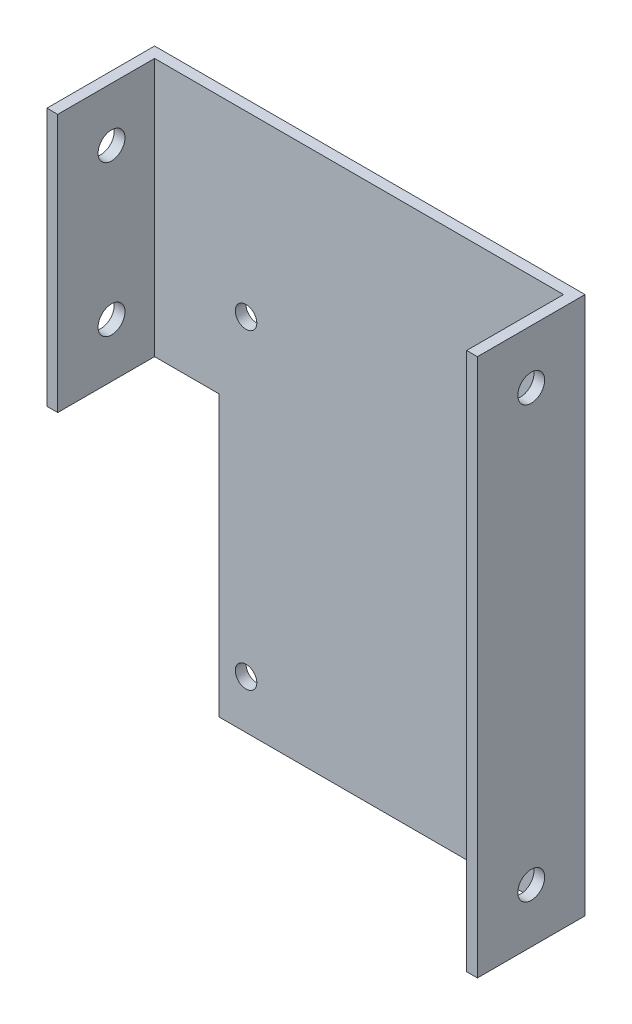
ISO-10303-21;
HEADER;
FILE_DESCRIPTION(('STEP AP214'),'2;1');
FILE_NAME('part.step','',(''),(''),'','','');
FILE_SCHEMA(('AUTOMOTIVE_DESIGN { 1 0 10303 214 1 1 1 1 }'));
ENDSEC;
DATA;
#1=APPLICATION_CONTEXT('core data for automotive mechanical design processes');
#2=APPLICATION_PROTOCOL_DEFINITION('international standard','automotive_design',2000,#1);
#3=PRODUCT_CONTEXT('',#1,'mechanical');
#4=PRODUCT('Part','Part','',(#3));
#5=PRODUCT_RELATED_PRODUCT_CATEGORY('part','',(#4));
#6=PRODUCT_DEFINITION_FORMATION('','',#4);
#7=PRODUCT_DEFINITION_CONTEXT('part definition',#1,'design');
#8=PRODUCT_DEFINITION('design','',#6,#7);
#9=PRODUCT_DEFINITION_SHAPE('','',#8);
#10=(LENGTH_UNIT() NAMED_UNIT(*) SI_UNIT(.MILLI.,.METRE.));
#11=(NAMED_UNIT(*) PLANE_ANGLE_UNIT() SI_UNIT($,.RADIAN.));
#12=(NAMED_UNIT(*) SI_UNIT($,.STERADIAN.) SOLID_ANGLE_UNIT());
#13=UNCERTAINTY_MEASURE_WITH_UNIT(LENGTH_MEASURE(1.E-05),#10,'distance_accuracy_value','');
#14=(GEOMETRIC_REPRESENTATION_CONTEXT(3) GLOBAL_UNCERTAINTY_ASSIGNED_CONTEXT((#13)) GLOBAL_UNIT_ASSIGNED_CONTEXT((#10,
#11,#12)) REPRESENTATION_CONTEXT('',''));
#15=CARTESIAN_POINT('',(0.,0.,0.));
#16=DIRECTION('',(0.,0.,1.));
#17=DIRECTION('',(1.,0.,0.));
#18=AXIS2_PLACEMENT_3D('',#15,#16,#17);
#19=CARTESIAN_POINT('',(0.,0.,1.));
#20=DIRECTION('',(0.,0.,1.));
#21=DIRECTION('',(1.,0.,0.));
#22=AXIS2_PLACEMENT_3D('',#19,#20,#21);
#23=PLANE('',#22);
#24=CARTESIAN_POINT('',(21.7424242424243,-25.6731601731602,0.999999999999999));
#25=DIRECTION('',(0.,0.,1.));
#26=DIRECTION('',(1.,0.,0.));
#27=AXIS2_PLACEMENT_3D('',#24,#25,#26);
#28=CIRCLE('',#27,1.);
#29=CARTESIAN_POINT('',(22.7424242424243,-25.6731601731602,0.999999999999999));
#30=VERTEX_POINT('',#29);
#31=EDGE_CURVE('E178',#30,#30,#28,.T.);
#32=ORIENTED_EDGE('',*,*,#31,.F.);
#33=EDGE_LOOP('',(#32));
#34=FACE_BOUND('',#33,.T.);
#35=CARTESIAN_POINT('',(-6.25757575757574,3.27845273006564,0.999999999999999));
#36=DIRECTION('',(0.,0.,1.));
#37=DIRECTION('',(1.,0.,0.));
#38=AXIS2_PLACEMENT_3D('',#35,#36,#37);
#39=CIRCLE('',#38,1.);
#40=CARTESIAN_POINT('',(-5.25757575757574,3.27845273006564,0.999999999999999));
#41=VERTEX_POINT('',#40);
#42=EDGE_CURVE('E174',#41,#41,#39,.T.);
#43=ORIENTED_EDGE('',*,*,#42,.F.);
#44=EDGE_LOOP('',(#43));
#45=FACE_BOUND('',#44,.T.);
#46=CARTESIAN_POINT('',(-6.25757575757574,-25.6731601731602,0.999999999999999));
#47=DIRECTION('',(0.,0.,1.));
#48=DIRECTION('',(1.,0.,0.));
#49=AXIS2_PLACEMENT_3D('',#46,#47,#48);
#50=CIRCLE('',#49,1.);
#51=CARTESIAN_POINT('',(-5.25757575757574,-25.6731601731602,0.999999999999999));
#52=VERTEX_POINT('',#51);
#53=EDGE_CURVE('E170',#52,#52,#50,.T.);
#54=ORIENTED_EDGE('',*,*,#53,.F.);
#55=EDGE_LOOP('',(#54));
#56=FACE_BOUND('',#55,.T.);
#57=CARTESIAN_POINT('',(21.7424242424243,3.32683982683982,0.999999999999999));
#58=DIRECTION('',(0.,0.,1.));
#59=DIRECTION('',(1.,0.,0.));
#60=AXIS2_PLACEMENT_3D('',#57,#58,#59);
#61=CIRCLE('',#60,1.);
#62=CARTESIAN_POINT('',(22.7424242424243,3.32683982683982,0.999999999999999));
#63=VERTEX_POINT('',#62);
#64=EDGE_CURVE('E166',#63,#63,#61,.T.);
#65=ORIENTED_EDGE('',*,*,#64,.F.);
#66=EDGE_LOOP('',(#65));
#67=FACE_BOUND('',#66,.T.);
#68=DIRECTION('',(1.,0.,0.));
#69=VECTOR('',#68,1.);
#70=CARTESIAN_POINT('',(24.2424242424243,-30.1731601731602,0.999999999999999));
#71=LINE('',#70,#69);
#72=CARTESIAN_POINT('',(-8.75757575757574,-30.1731601731602,0.999999999999999));
#73=VERTEX_POINT('',#72);
#74=CARTESIAN_POINT('',(23.2424242424242,-30.1731601731602,0.999999999999999));
#75=VERTEX_POINT('',#74);
#76=EDGE_CURVE('E140',#73,#75,#71,.T.);
#77=ORIENTED_EDGE('',*,*,#76,.T.);
#78=DIRECTION('',(0.,-1.,0.));
#79=VECTOR('',#78,1.);
#80=CARTESIAN_POINT('',(23.2424242424242,0.,1.));
#81=LINE('',#80,#79);
#82=CARTESIAN_POINT('',(23.2424242424242,19.8268398268398,1.));
#83=VERTEX_POINT('',#82);
#84=EDGE_CURVE('E61',#83,#75,#81,.T.);
#85=ORIENTED_EDGE('',*,*,#84,.F.);
#86=DIRECTION('',(-1.,0.,0.));
#87=VECTOR('',#86,1.);
#88=CARTESIAN_POINT('',(-15.7575757575758,19.8268398268398,1.));
#89=LINE('',#88,#87);
#90=CARTESIAN_POINT('',(-14.7575757575758,19.8268398268398,1.));
#91=VERTEX_POINT('',#90);
#92=EDGE_CURVE('E260',#83,#91,#89,.T.);
#93=ORIENTED_EDGE('',*,*,#92,.T.);
#94=DIRECTION('',(0.,1.,0.));
#95=VECTOR('',#94,1.);
#96=CARTESIAN_POINT('',(-14.7575757575758,0.,1.));
#97=LINE('',#96,#95);
#98=CARTESIAN_POINT('',(-14.7575757575758,-4.17316017316017,1.));
#99=VERTEX_POINT('',#98);
#100=EDGE_CURVE('E256',#99,#91,#97,.T.);
#101=ORIENTED_EDGE('',*,*,#100,.F.);
#102=DIRECTION('',(1.,0.,0.));
#103=VECTOR('',#102,1.);
#104=CARTESIAN_POINT('',(-15.7575757575758,-4.17316017316017,1.));
#105=LINE('',#104,#103);
#106=CARTESIAN_POINT('',(-8.75757575757575,-4.17316017316017,1.));
#107=VERTEX_POINT('',#106);
#108=EDGE_CURVE('E199',#99,#107,#105,.T.);
#109=ORIENTED_EDGE('',*,*,#108,.T.);
#110=DIRECTION('',(0.,1.,0.));
#111=VECTOR('',#110,1.);
#112=CARTESIAN_POINT('',(-8.75757575757575,-5.17316017316017,1.));
#113=LINE('',#112,#111);
#114=EDGE_CURVE('E210',#73,#107,#113,.T.);
#115=ORIENTED_EDGE('',*,*,#114,.F.);
#116=EDGE_LOOP('',(#77,#85,#93,#101,#109,#115));
#117=FACE_BOUND('',#116,.T.);
#118=ADVANCED_FACE('F43',(#34,#45,#56,#67,#117),#23,.T.);
#119=CARTESIAN_POINT('',(-15.7575757575757,-30.1731601731602,1.));
#120=DIRECTION('',(0.,1.,0.));
#121=DIRECTION('',(0.,0.,1.));
#122=AXIS2_PLACEMENT_3D('',#119,#120,#121);
#123=PLANE('',#122);
#124=ORIENTED_EDGE('',*,*,#76,.F.);
#125=DIRECTION('',(0.,0.,1.));
#126=VECTOR('',#125,1.);
#127=CARTESIAN_POINT('',(-8.75757575757574,-30.1731601731602,-52.));
#128=LINE('',#127,#126);
#129=CARTESIAN_POINT('',(-8.75757575757574,-30.1731601731602,0.));
#130=VERTEX_POINT('',#129);
#131=EDGE_CURVE('E216',#130,#73,#128,.T.);
#132=ORIENTED_EDGE('',*,*,#131,.F.);
#133=DIRECTION('',(1.,0.,0.));
#134=VECTOR('',#133,1.);
#135=CARTESIAN_POINT('',(-15.7575757575757,-30.1731601731602,0.));
#136=LINE('',#135,#134);
#137=CARTESIAN_POINT('',(24.2424242424243,-30.1731601731602,0.));
#138=VERTEX_POINT('',#137);
#139=EDGE_CURVE('E268',#130,#138,#136,.T.);
#140=ORIENTED_EDGE('',*,*,#139,.T.);
#141=DIRECTION('',(0.,0.,-1.));
#142=VECTOR('',#141,1.);
#143=CARTESIAN_POINT('',(24.2424242424243,-30.1731601731602,1.));
#144=LINE('',#143,#142);
#145=CARTESIAN_POINT('',(24.2424242424243,-30.1731601731602,10.));
#146=VERTEX_POINT('',#145);
#147=EDGE_CURVE('E53',#146,#138,#144,.T.);
#148=ORIENTED_EDGE('',*,*,#147,.F.);
#149=DIRECTION('',(1.,0.,0.));
#150=VECTOR('',#149,1.);
#151=CARTESIAN_POINT('',(24.2424242424243,-30.1731601731602,10.));
#152=LINE('',#151,#150);
#153=CARTESIAN_POINT('',(23.2424242424242,-30.1731601731602,10.));
#154=VERTEX_POINT('',#153);
#155=EDGE_CURVE('E127',#154,#146,#152,.T.);
#156=ORIENTED_EDGE('',*,*,#155,.F.);
#157=DIRECTION('',(0.,0.,-1.));
#158=VECTOR('',#157,1.);
#159=CARTESIAN_POINT('',(23.2424242424242,-30.1731601731602,10.));
#160=LINE('',#159,#158);
#161=EDGE_CURVE('E135',#154,#75,#160,.T.);
#162=ORIENTED_EDGE('',*,*,#161,.T.);
#163=EDGE_LOOP('',(#124,#132,#140,#148,#156,#162));
#164=FACE_BOUND('',#163,.T.);
#165=ADVANCED_FACE('F142',(#164),#123,.F.);
#166=CARTESIAN_POINT('',(-8.75757575757575,-5.17316017316017,-52.));
#167=DIRECTION('',(1.,0.,0.));
#168=DIRECTION('',(0.,1.,0.));
#169=AXIS2_PLACEMENT_3D('',#166,#167,#168);
#170=PLANE('',#169);
#171=ORIENTED_EDGE('',*,*,#131,.T.);
#172=ORIENTED_EDGE('',*,*,#114,.T.);
#173=DIRECTION('',(0.,0.,1.));
#174=VECTOR('',#173,1.);
#175=CARTESIAN_POINT('',(-8.75757575757574,-4.17316017316017,0.));
#176=LINE('',#175,#174);
#177=CARTESIAN_POINT('',(-8.75757575757575,-4.17316017316017,0.));
#178=VERTEX_POINT('',#177);
#179=EDGE_CURVE('E69',#178,#107,#176,.T.);
#180=ORIENTED_EDGE('',*,*,#179,.F.);
#181=DIRECTION('',(0.,1.,0.));
#182=VECTOR('',#181,1.);
#183=CARTESIAN_POINT('',(-8.75757575757575,0.,0.));
#184=LINE('',#183,#182);
#185=EDGE_CURVE('E11',#130,#178,#184,.T.);
#186=ORIENTED_EDGE('',*,*,#185,.F.);
#187=EDGE_LOOP('',(#171,#172,#180,#186));
#188=FACE_BOUND('',#187,.T.);
#189=ADVANCED_FACE('F323',(#188),#170,.F.);
#190=CARTESIAN_POINT('',(23.2424242424242,19.8268398268398,10.));
#191=DIRECTION('',(-1.,0.,0.));
#192=DIRECTION('',(0.,-1.,0.));
#193=AXIS2_PLACEMENT_3D('',#190,#191,#192);
#194=PLANE('',#193);
#195=CARTESIAN_POINT('',(23.2424242424242,-25.1731601731602,5.));
#196=DIRECTION('',(-1.,0.,0.));
#197=DIRECTION('',(0.,-1.,0.));
#198=AXIS2_PLACEMENT_3D('',#195,#196,#197);
#199=CIRCLE('',#198,1.25);
#200=CARTESIAN_POINT('',(23.2424242424242,-26.4231601731602,5.));
#201=VERTEX_POINT('',#200);
#202=EDGE_CURVE('E47',#201,#201,#199,.T.);
#203=ORIENTED_EDGE('',*,*,#202,.F.);
#204=EDGE_LOOP('',(#203));
#205=FACE_BOUND('',#204,.T.);
#206=CARTESIAN_POINT('',(23.2424242424242,14.8268398268398,5.));
#207=DIRECTION('',(-1.,0.,0.));
#208=DIRECTION('',(0.,-1.,0.));
#209=AXIS2_PLACEMENT_3D('',#206,#207,#208);
#210=CIRCLE('',#209,1.25);
#211=CARTESIAN_POINT('',(23.2424242424242,13.5768398268398,5.));
#212=VERTEX_POINT('',#211);
#213=EDGE_CURVE('E224',#212,#212,#210,.T.);
#214=ORIENTED_EDGE('',*,*,#213,.F.);
#215=EDGE_LOOP('',(#214));
#216=FACE_BOUND('',#215,.T.);
#217=ORIENTED_EDGE('',*,*,#84,.T.);
#218=ORIENTED_EDGE('',*,*,#161,.F.);
#219=DIRECTION('',(0.,1.,0.));
#220=VECTOR('',#219,1.);
#221=CARTESIAN_POINT('',(23.2424242424242,19.8268398268398,10.));
#222=LINE('',#221,#220);
#223=CARTESIAN_POINT('',(23.2424242424242,19.8268398268398,10.));
#224=VERTEX_POINT('',#223);
#225=EDGE_CURVE('E123',#154,#224,#222,.T.);
#226=ORIENTED_EDGE('',*,*,#225,.T.);
#227=DIRECTION('',(0.,0.,-1.));
#228=VECTOR('',#227,1.);
#229=CARTESIAN_POINT('',(23.2424242424242,19.8268398268398,10.));
#230=LINE('',#229,#228);
#231=EDGE_CURVE('E233',#224,#83,#230,.T.);
#232=ORIENTED_EDGE('',*,*,#231,.T.);
#233=EDGE_LOOP('',(#217,#218,#226,#232));
#234=FACE_BOUND('',#233,.T.);
#235=ADVANCED_FACE('F136',(#205,#216,#234),#194,.T.);
#236=CARTESIAN_POINT('',(-15.7575757575758,19.8268398268398,1.));
#237=DIRECTION('',(1.,0.,0.));
#238=DIRECTION('',(0.,1.,0.));
#239=AXIS2_PLACEMENT_3D('',#236,#237,#238);
#240=PLANE('',#239);
#241=CARTESIAN_POINT('',(-15.7575757575758,0.826839826839827,5.));
#242=DIRECTION('',(-1.,0.,0.));
#243=DIRECTION('',(0.,-1.,0.));
#244=AXIS2_PLACEMENT_3D('',#241,#242,#243);
#245=CIRCLE('',#244,1.25);
#246=CARTESIAN_POINT('',(-15.7575757575758,-0.423160173160173,5.));
#247=VERTEX_POINT('',#246);
#248=EDGE_CURVE('E186',#247,#247,#245,.T.);
#249=ORIENTED_EDGE('',*,*,#248,.F.);
#250=EDGE_LOOP('',(#249));
#251=FACE_BOUND('',#250,.T.);
#252=DIRECTION('',(0.,0.,1.));
#253=VECTOR('',#252,1.);
#254=CARTESIAN_POINT('',(-15.7575757575758,-4.17316017316017,0.));
#255=LINE('',#254,#253);
#256=CARTESIAN_POINT('',(-15.7575757575758,-4.17316017316017,0.));
#257=VERTEX_POINT('',#256);
#258=CARTESIAN_POINT('',(-15.7575757575758,-4.17316017316017,10.));
#259=VERTEX_POINT('',#258);
#260=EDGE_CURVE('E204',#257,#259,#255,.T.);
#261=ORIENTED_EDGE('',*,*,#260,.T.);
#262=DIRECTION('',(0.,1.,0.));
#263=VECTOR('',#262,1.);
#264=CARTESIAN_POINT('',(-15.7575757575758,19.8268398268398,10.));
#265=LINE('',#264,#263);
#266=CARTESIAN_POINT('',(-15.7575757575758,19.8268398268398,10.));
#267=VERTEX_POINT('',#266);
#268=EDGE_CURVE('E242',#259,#267,#265,.T.);
#269=ORIENTED_EDGE('',*,*,#268,.T.);
#270=DIRECTION('',(0.,0.,-1.));
#271=VECTOR('',#270,1.);
#272=CARTESIAN_POINT('',(-15.7575757575758,19.8268398268398,1.));
#273=LINE('',#272,#271);
#274=CARTESIAN_POINT('',(-15.7575757575758,19.8268398268398,0.));
#275=VERTEX_POINT('',#274);
#276=EDGE_CURVE('E264',#267,#275,#273,.T.);
#277=ORIENTED_EDGE('',*,*,#276,.T.);
#278=DIRECTION('',(0.,-1.,0.));
#279=VECTOR('',#278,1.);
#280=CARTESIAN_POINT('',(-15.7575757575758,19.8268398268398,0.));
#281=LINE('',#280,#279);
#282=EDGE_CURVE('E259',#275,#257,#281,.T.);
#283=ORIENTED_EDGE('',*,*,#282,.T.);
#284=EDGE_LOOP('',(#261,#269,#277,#283));
#285=FACE_BOUND('',#284,.T.);
#286=CARTESIAN_POINT('',(-15.7575757575758,14.8268398268398,5.));
#287=DIRECTION('',(1.,0.,0.));
#288=DIRECTION('',(0.,1.,0.));
#289=AXIS2_PLACEMENT_3D('',#286,#287,#288);
#290=CIRCLE('',#289,1.25);
#291=CARTESIAN_POINT('',(-15.7575757575758,16.0768398268398,5.));
#292=VERTEX_POINT('',#291);
#293=EDGE_CURVE('E229',#292,#292,#290,.T.);
#294=ORIENTED_EDGE('',*,*,#293,.T.);
#295=EDGE_LOOP('',(#294));
#296=FACE_BOUND('',#295,.T.);
#297=ADVANCED_FACE('F45',(#251,#285,#296),#240,.F.);
#298=CARTESIAN_POINT('',(24.2424242424242,19.8268398268398,1.));
#299=DIRECTION('',(-1.,0.,0.));
#300=DIRECTION('',(0.,-1.,0.));
#301=AXIS2_PLACEMENT_3D('',#298,#299,#300);
#302=PLANE('',#301);
#303=DIRECTION('',(0.,-1.,0.));
#304=VECTOR('',#303,1.);
#305=CARTESIAN_POINT('',(24.2424242424242,19.8268398268398,10.));
#306=LINE('',#305,#304);
#307=CARTESIAN_POINT('',(24.2424242424242,19.8268398268398,10.));
#308=VERTEX_POINT('',#307);
#309=EDGE_CURVE('E132',#308,#146,#306,.T.);
#310=ORIENTED_EDGE('',*,*,#309,.T.);
#311=ORIENTED_EDGE('',*,*,#147,.T.);
#312=DIRECTION('',(0.,1.,0.));
#313=VECTOR('',#312,1.);
#314=CARTESIAN_POINT('',(24.2424242424242,19.8268398268398,0.));
#315=LINE('',#314,#313);
#316=CARTESIAN_POINT('',(24.2424242424242,19.8268398268398,0.));
#317=VERTEX_POINT('',#316);
#318=EDGE_CURVE('E271',#138,#317,#315,.T.);
#319=ORIENTED_EDGE('',*,*,#318,.T.);
#320=DIRECTION('',(0.,0.,-1.));
#321=VECTOR('',#320,1.);
#322=CARTESIAN_POINT('',(24.2424242424242,19.8268398268398,1.));
#323=LINE('',#322,#321);
#324=EDGE_CURVE('E279',#308,#317,#323,.T.);
#325=ORIENTED_EDGE('',*,*,#324,.F.);
#326=EDGE_LOOP('',(#310,#311,#319,#325));
#327=FACE_BOUND('',#326,.T.);
#328=CARTESIAN_POINT('',(24.2424242424242,14.8268398268398,5.));
#329=DIRECTION('',(1.,0.,0.));
#330=DIRECTION('',(0.,1.,0.));
#331=AXIS2_PLACEMENT_3D('',#328,#329,#330);
#332=CIRCLE('',#331,1.25);
#333=CARTESIAN_POINT('',(24.2424242424242,16.0768398268398,5.));
#334=VERTEX_POINT('',#333);
#335=EDGE_CURVE('E220',#334,#334,#332,.T.);
#336=ORIENTED_EDGE('',*,*,#335,.F.);
#337=EDGE_LOOP('',(#336));
#338=FACE_BOUND('',#337,.T.);
#339=CARTESIAN_POINT('',(24.2424242424243,-25.1731601731602,5.));
#340=DIRECTION('',(1.,0.,0.));
#341=DIRECTION('',(0.,1.,0.));
#342=AXIS2_PLACEMENT_3D('',#339,#340,#341);
#343=CIRCLE('',#342,1.25);
#344=CARTESIAN_POINT('',(24.2424242424243,-23.9231601731602,5.));
#345=VERTEX_POINT('',#344);
#346=EDGE_CURVE('E182',#345,#345,#343,.T.);
#347=ORIENTED_EDGE('',*,*,#346,.F.);
#348=EDGE_LOOP('',(#347));
#349=FACE_BOUND('',#348,.T.);
#350=ADVANCED_FACE('F313',(#327,#338,#349),#302,.F.);
#351=CARTESIAN_POINT('',(-15.7575757575758,19.8268398268398,1.));
#352=DIRECTION('',(0.,-1.,0.));
#353=DIRECTION('',(0.,0.,-1.));
#354=AXIS2_PLACEMENT_3D('',#351,#352,#353);
#355=PLANE('',#354);
#356=ORIENTED_EDGE('',*,*,#92,.F.);
#357=ORIENTED_EDGE('',*,*,#231,.F.);
#358=DIRECTION('',(1.,0.,0.));
#359=VECTOR('',#358,1.);
#360=CARTESIAN_POINT('',(24.2424242424242,19.8268398268398,10.));
#361=LINE('',#360,#359);
#362=EDGE_CURVE('E129',#224,#308,#361,.T.);
#363=ORIENTED_EDGE('',*,*,#362,.T.);
#364=ORIENTED_EDGE('',*,*,#324,.T.);
#365=DIRECTION('',(-1.,0.,0.));
#366=VECTOR('',#365,1.);
#367=CARTESIAN_POINT('',(-15.7575757575758,19.8268398268398,0.));
#368=LINE('',#367,#366);
#369=EDGE_CURVE('E265',#317,#275,#368,.T.);
#370=ORIENTED_EDGE('',*,*,#369,.T.);
#371=ORIENTED_EDGE('',*,*,#276,.F.);
#372=DIRECTION('',(1.,0.,0.));
#373=VECTOR('',#372,1.);
#374=CARTESIAN_POINT('',(-15.7575757575758,19.8268398268398,10.));
#375=LINE('',#374,#373);
#376=CARTESIAN_POINT('',(-14.7575757575758,19.8268398268398,10.));
#377=VERTEX_POINT('',#376);
#378=EDGE_CURVE('E245',#267,#377,#375,.T.);
#379=ORIENTED_EDGE('',*,*,#378,.T.);
#380=DIRECTION('',(0.,0.,-1.));
#381=VECTOR('',#380,1.);
#382=CARTESIAN_POINT('',(-14.7575757575758,19.8268398268398,10.));
#383=LINE('',#382,#381);
#384=EDGE_CURVE('E252',#377,#91,#383,.T.);
#385=ORIENTED_EDGE('',*,*,#384,.T.);
#386=EDGE_LOOP('',(#356,#357,#363,#364,#370,#371,#379,#385));
#387=FACE_BOUND('',#386,.T.);
#388=ADVANCED_FACE('F319',(#387),#355,.F.);
#389=CARTESIAN_POINT('',(0.,0.,0.));
#390=DIRECTION('',(0.,0.,1.));
#391=DIRECTION('',(1.,0.,0.));
#392=AXIS2_PLACEMENT_3D('',#389,#390,#391);
#393=PLANE('',#392);
#394=CARTESIAN_POINT('',(21.7424242424243,-25.6731601731602,0.));
#395=DIRECTION('',(0.,0.,-1.));
#396=DIRECTION('',(-1.,0.,0.));
#397=AXIS2_PLACEMENT_3D('',#394,#395,#396);
#398=CIRCLE('',#397,1.);
#399=CARTESIAN_POINT('',(20.7424242424243,-25.6731601731602,0.));
#400=VERTEX_POINT('',#399);
#401=EDGE_CURVE('E150',#400,#400,#398,.T.);
#402=ORIENTED_EDGE('',*,*,#401,.F.);
#403=EDGE_LOOP('',(#402));
#404=FACE_BOUND('',#403,.T.);
#405=CARTESIAN_POINT('',(-6.25757575757574,3.27845273006564,0.));
#406=DIRECTION('',(0.,0.,-1.));
#407=DIRECTION('',(-1.,0.,0.));
#408=AXIS2_PLACEMENT_3D('',#405,#406,#407);
#409=CIRCLE('',#408,1.);
#410=CARTESIAN_POINT('',(-7.25757575757574,3.27845273006564,0.));
#411=VERTEX_POINT('',#410);
#412=EDGE_CURVE('E156',#411,#411,#409,.T.);
#413=ORIENTED_EDGE('',*,*,#412,.F.);
#414=EDGE_LOOP('',(#413));
#415=FACE_BOUND('',#414,.T.);
#416=CARTESIAN_POINT('',(-6.25757575757574,-25.6731601731602,0.));
#417=DIRECTION('',(0.,0.,-1.));
#418=DIRECTION('',(-1.,0.,0.));
#419=AXIS2_PLACEMENT_3D('',#416,#417,#418);
#420=CIRCLE('',#419,1.);
#421=CARTESIAN_POINT('',(-7.25757575757574,-25.6731601731602,0.));
#422=VERTEX_POINT('',#421);
#423=EDGE_CURVE('E151',#422,#422,#420,.T.);
#424=ORIENTED_EDGE('',*,*,#423,.F.);
#425=EDGE_LOOP('',(#424));
#426=FACE_BOUND('',#425,.T.);
#427=CARTESIAN_POINT('',(21.7424242424243,3.32683982683982,0.));
#428=DIRECTION('',(0.,0.,-1.));
#429=DIRECTION('',(-1.,0.,0.));
#430=AXIS2_PLACEMENT_3D('',#427,#428,#429);
#431=CIRCLE('',#430,1.);
#432=CARTESIAN_POINT('',(20.7424242424243,3.32683982683982,0.));
#433=VERTEX_POINT('',#432);
#434=EDGE_CURVE('E155',#433,#433,#431,.T.);
#435=ORIENTED_EDGE('',*,*,#434,.F.);
#436=EDGE_LOOP('',(#435));
#437=FACE_BOUND('',#436,.T.);
#438=ORIENTED_EDGE('',*,*,#185,.T.);
#439=DIRECTION('',(1.,0.,0.));
#440=VECTOR('',#439,1.);
#441=CARTESIAN_POINT('',(-15.7575757575758,-4.17316017316017,0.));
#442=LINE('',#441,#440);
#443=EDGE_CURVE('E200',#257,#178,#442,.T.);
#444=ORIENTED_EDGE('',*,*,#443,.F.);
#445=ORIENTED_EDGE('',*,*,#282,.F.);
#446=ORIENTED_EDGE('',*,*,#369,.F.);
#447=ORIENTED_EDGE('',*,*,#318,.F.);
#448=ORIENTED_EDGE('',*,*,#139,.F.);
#449=EDGE_LOOP('',(#438,#444,#445,#446,#447,#448));
#450=FACE_BOUND('',#449,.T.);
#451=ADVANCED_FACE('F298',(#404,#415,#426,#437,#450),#393,.F.);
#452=CARTESIAN_POINT('',(-14.7575757575758,19.8268398268398,10.));
#453=DIRECTION('',(1.,0.,0.));
#454=DIRECTION('',(0.,1.,0.));
#455=AXIS2_PLACEMENT_3D('',#452,#453,#454);
#456=PLANE('',#455);
#457=CARTESIAN_POINT('',(-14.7575757575758,0.826839826839827,5.));
#458=DIRECTION('',(1.,0.,0.));
#459=DIRECTION('',(0.,1.,0.));
#460=AXIS2_PLACEMENT_3D('',#457,#458,#459);
#461=CIRCLE('',#460,1.25);
#462=CARTESIAN_POINT('',(-14.7575757575758,2.07683982683983,5.));
#463=VERTEX_POINT('',#462);
#464=EDGE_CURVE('E190',#463,#463,#461,.T.);
#465=ORIENTED_EDGE('',*,*,#464,.F.);
#466=EDGE_LOOP('',(#465));
#467=FACE_BOUND('',#466,.T.);
#468=DIRECTION('',(0.,-1.,0.));
#469=VECTOR('',#468,1.);
#470=CARTESIAN_POINT('',(-14.7575757575758,19.8268398268398,10.));
#471=LINE('',#470,#469);
#472=CARTESIAN_POINT('',(-14.7575757575758,-4.17316017316017,10.));
#473=VERTEX_POINT('',#472);
#474=EDGE_CURVE('E249',#377,#473,#471,.T.);
#475=ORIENTED_EDGE('',*,*,#474,.T.);
#476=DIRECTION('',(0.,0.,-1.));
#477=VECTOR('',#476,1.);
#478=CARTESIAN_POINT('',(-14.7575757575758,-4.17316017316017,10.));
#479=LINE('',#478,#477);
#480=EDGE_CURVE('E195',#473,#99,#479,.T.);
#481=ORIENTED_EDGE('',*,*,#480,.T.);
#482=ORIENTED_EDGE('',*,*,#100,.T.);
#483=ORIENTED_EDGE('',*,*,#384,.F.);
#484=EDGE_LOOP('',(#475,#481,#482,#483));
#485=FACE_BOUND('',#484,.T.);
#486=CARTESIAN_POINT('',(-14.7575757575758,14.8268398268398,5.));
#487=DIRECTION('',(1.,0.,0.));
#488=DIRECTION('',(0.,1.,0.));
#489=AXIS2_PLACEMENT_3D('',#486,#487,#488);
#490=CIRCLE('',#489,1.25);
#491=CARTESIAN_POINT('',(-14.7575757575758,16.0768398268398,5.));
#492=VERTEX_POINT('',#491);
#493=EDGE_CURVE('E225',#492,#492,#490,.T.);
#494=ORIENTED_EDGE('',*,*,#493,.F.);
#495=EDGE_LOOP('',(#494));
#496=FACE_BOUND('',#495,.T.);
#497=ADVANCED_FACE('F294',(#467,#485,#496),#456,.T.);
#498=CARTESIAN_POINT('',(0.,0.,10.));
#499=DIRECTION('',(0.,0.,1.));
#500=DIRECTION('',(1.,0.,0.));
#501=AXIS2_PLACEMENT_3D('',#498,#499,#500);
#502=PLANE('',#501);
#503=ORIENTED_EDGE('',*,*,#268,.F.);
#504=DIRECTION('',(1.,0.,0.));
#505=VECTOR('',#504,1.);
#506=CARTESIAN_POINT('',(-15.7575757575758,-4.17316017316017,10.));
#507=LINE('',#506,#505);
#508=EDGE_CURVE('E191',#259,#473,#507,.T.);
#509=ORIENTED_EDGE('',*,*,#508,.T.);
#510=ORIENTED_EDGE('',*,*,#474,.F.);
#511=ORIENTED_EDGE('',*,*,#378,.F.);
#512=EDGE_LOOP('',(#503,#509,#510,#511));
#513=FACE_BOUND('',#512,.T.);
#514=ADVANCED_FACE('F297',(#513),#502,.T.);
#515=CARTESIAN_POINT('',(0.,0.,10.));
#516=DIRECTION('',(0.,0.,-1.));
#517=DIRECTION('',(-1.,0.,0.));
#518=AXIS2_PLACEMENT_3D('',#515,#516,#517);
#519=PLANE('',#518);
#520=ORIENTED_EDGE('',*,*,#225,.F.);
#521=ORIENTED_EDGE('',*,*,#155,.T.);
#522=ORIENTED_EDGE('',*,*,#309,.F.);
#523=ORIENTED_EDGE('',*,*,#362,.F.);
#524=EDGE_LOOP('',(#520,#521,#522,#523));
#525=FACE_BOUND('',#524,.T.);
#526=ADVANCED_FACE('F124',(#525),#519,.F.);
#527=CARTESIAN_POINT('',(-38.7575757575758,14.8268398268398,5.));
#528=DIRECTION('',(1.,0.,0.));
#529=DIRECTION('',(0.,1.,0.));
#530=AXIS2_PLACEMENT_3D('',#527,#528,#529);
#531=CYLINDRICAL_SURFACE('',#530,1.25);
#532=ORIENTED_EDGE('',*,*,#213,.T.);
#533=EDGE_LOOP('',(#532));
#534=FACE_BOUND('',#533,.T.);
#535=ORIENTED_EDGE('',*,*,#335,.T.);
#536=EDGE_LOOP('',(#535));
#537=FACE_BOUND('',#536,.T.);
#538=ADVANCED_FACE('F308',(#534,#537),#531,.F.);
#539=ORIENTED_EDGE('',*,*,#493,.T.);
#540=EDGE_LOOP('',(#539));
#541=FACE_BOUND('',#540,.T.);
#542=ORIENTED_EDGE('',*,*,#293,.F.);
#543=EDGE_LOOP('',(#542));
#544=FACE_BOUND('',#543,.T.);
#545=ADVANCED_FACE('F304',(#541,#544),#531,.F.);
#546=CARTESIAN_POINT('',(-15.7575757575758,-4.17316017316017,0.));
#547=DIRECTION('',(0.,-1.,0.));
#548=DIRECTION('',(0.,0.,-1.));
#549=AXIS2_PLACEMENT_3D('',#546,#547,#548);
#550=PLANE('',#549);
#551=ORIENTED_EDGE('',*,*,#108,.F.);
#552=ORIENTED_EDGE('',*,*,#480,.F.);
#553=ORIENTED_EDGE('',*,*,#508,.F.);
#554=ORIENTED_EDGE('',*,*,#260,.F.);
#555=ORIENTED_EDGE('',*,*,#443,.T.);
#556=ORIENTED_EDGE('',*,*,#179,.T.);
#557=EDGE_LOOP('',(#551,#552,#553,#554,#555,#556));
#558=FACE_BOUND('',#557,.T.);
#559=ADVANCED_FACE('F307',(#558),#550,.T.);
#560=CARTESIAN_POINT('',(-6.75757575757575,0.826839826839828,5.));
#561=DIRECTION('',(-1.,0.,0.));
#562=DIRECTION('',(0.,-1.,0.));
#563=AXIS2_PLACEMENT_3D('',#560,#561,#562);
#564=CYLINDRICAL_SURFACE('',#563,1.25);
#565=ORIENTED_EDGE('',*,*,#464,.T.);
#566=EDGE_LOOP('',(#565));
#567=FACE_BOUND('',#566,.T.);
#568=ORIENTED_EDGE('',*,*,#248,.T.);
#569=EDGE_LOOP('',(#568));
#570=FACE_BOUND('',#569,.T.);
#571=ADVANCED_FACE('F291',(#567,#570),#564,.F.);
#572=CARTESIAN_POINT('',(15.2424242424243,-25.1731601731602,5.));
#573=DIRECTION('',(1.,0.,0.));
#574=DIRECTION('',(0.,1.,0.));
#575=AXIS2_PLACEMENT_3D('',#572,#573,#574);
#576=CYLINDRICAL_SURFACE('',#575,1.25);
#577=ORIENTED_EDGE('',*,*,#202,.T.);
#578=EDGE_LOOP('',(#577));
#579=FACE_BOUND('',#578,.T.);
#580=ORIENTED_EDGE('',*,*,#346,.T.);
#581=EDGE_LOOP('',(#580));
#582=FACE_BOUND('',#581,.T.);
#583=ADVANCED_FACE('F368',(#579,#582),#576,.F.);
#584=CARTESIAN_POINT('',(21.7424242424243,3.32683982683982,10.));
#585=DIRECTION('',(0.,0.,-1.));
#586=DIRECTION('',(-1.,0.,0.));
#587=AXIS2_PLACEMENT_3D('',#584,#585,#586);
#588=CYLINDRICAL_SURFACE('',#587,1.);
#589=ORIENTED_EDGE('',*,*,#64,.T.);
#590=EDGE_LOOP('',(#589));
#591=FACE_BOUND('',#590,.T.);
#592=ORIENTED_EDGE('',*,*,#434,.T.);
#593=EDGE_LOOP('',(#592));
#594=FACE_BOUND('',#593,.T.);
#595=ADVANCED_FACE('F370',(#591,#594),#588,.F.);
#596=CARTESIAN_POINT('',(-6.25757575757574,-25.6731601731602,10.));
#597=DIRECTION('',(0.,0.,-1.));
#598=DIRECTION('',(-1.,0.,0.));
#599=AXIS2_PLACEMENT_3D('',#596,#597,#598);
#600=CYLINDRICAL_SURFACE('',#599,1.);
#601=ORIENTED_EDGE('',*,*,#53,.T.);
#602=EDGE_LOOP('',(#601));
#603=FACE_BOUND('',#602,.T.);
#604=ORIENTED_EDGE('',*,*,#423,.T.);
#605=EDGE_LOOP('',(#604));
#606=FACE_BOUND('',#605,.T.);
#607=ADVANCED_FACE('F377',(#603,#606),#600,.F.);
#608=CARTESIAN_POINT('',(-6.25757575757574,3.27845273006564,10.));
#609=DIRECTION('',(0.,0.,-1.));
#610=DIRECTION('',(-1.,0.,0.));
#611=AXIS2_PLACEMENT_3D('',#608,#609,#610);
#612=CYLINDRICAL_SURFACE('',#611,1.);
#613=ORIENTED_EDGE('',*,*,#42,.T.);
#614=EDGE_LOOP('',(#613));
#615=FACE_BOUND('',#614,.T.);
#616=ORIENTED_EDGE('',*,*,#412,.T.);
#617=EDGE_LOOP('',(#616));
#618=FACE_BOUND('',#617,.T.);
#619=ADVANCED_FACE('F436',(#615,#618),#612,.F.);
#620=CARTESIAN_POINT('',(21.7424242424243,-25.6731601731602,10.));
#621=DIRECTION('',(0.,0.,-1.));
#622=DIRECTION('',(-1.,0.,0.));
#623=AXIS2_PLACEMENT_3D('',#620,#621,#622);
#624=CYLINDRICAL_SURFACE('',#623,1.);
#625=ORIENTED_EDGE('',*,*,#31,.T.);
#626=EDGE_LOOP('',(#625));
#627=FACE_BOUND('',#626,.T.);
#628=ORIENTED_EDGE('',*,*,#401,.T.);
#629=EDGE_LOOP('',(#628));
#630=FACE_BOUND('',#629,.T.);
#631=ADVANCED_FACE('F447',(#627,#630),#624,.F.);
#632=CLOSED_SHELL('',(#118,#165,#189,#235,#297,#350,#388,#451,#497,#514,#526,#538,#545,#559,
#571,#583,#595,#607,#619,#631));
#633=MANIFOLD_SOLID_BREP('B2',#632);
#634=ADVANCED_BREP_SHAPE_REPRESENTATION('',(#18,#633),#14);
#635=SHAPE_DEFINITION_REPRESENTATION(#9,#634);
ENDSEC;
END-ISO-10303-21;
